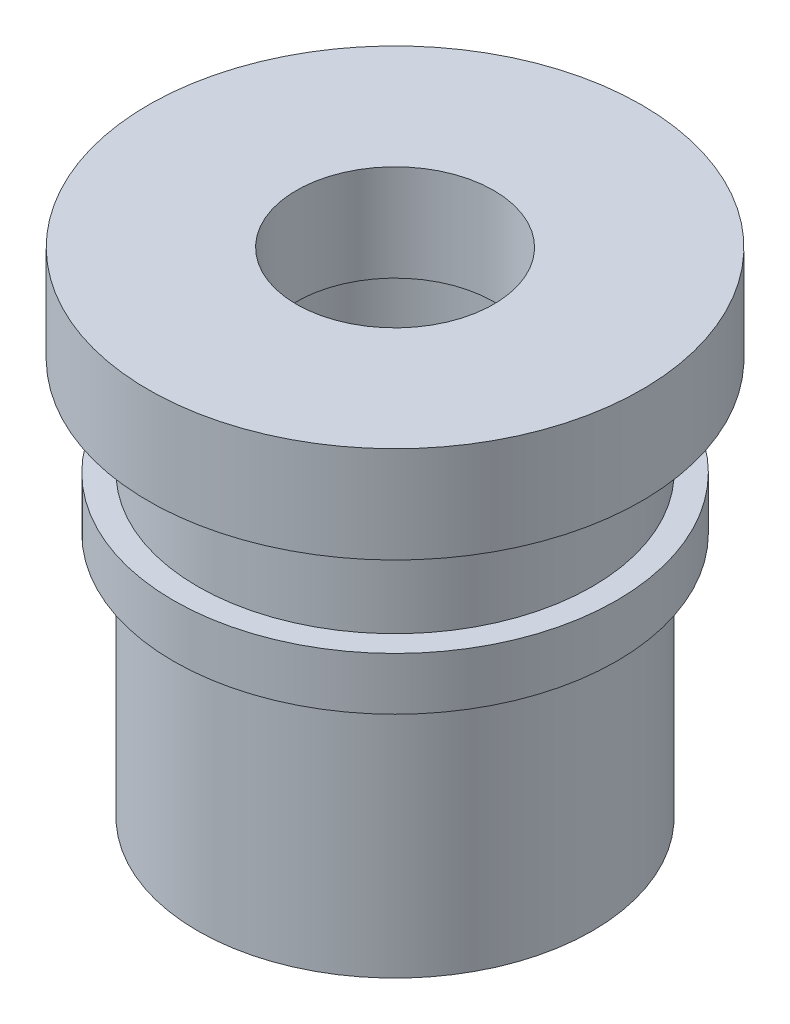
ISO-10303-21;
HEADER;
FILE_DESCRIPTION(('STEP AP214'),'2;1');
FILE_NAME('part.step','',(''),(''),'','','');
FILE_SCHEMA(('AUTOMOTIVE_DESIGN { 1 0 10303 214 1 1 1 1 }'));
ENDSEC;
DATA;
#1=APPLICATION_CONTEXT('core data for automotive mechanical design processes');
#2=APPLICATION_PROTOCOL_DEFINITION('international standard','automotive_design',2000,#1);
#3=PRODUCT_CONTEXT('',#1,'mechanical');
#4=PRODUCT('Part','Part','',(#3));
#5=PRODUCT_RELATED_PRODUCT_CATEGORY('part','',(#4));
#6=PRODUCT_DEFINITION_FORMATION('','',#4);
#7=PRODUCT_DEFINITION_CONTEXT('part definition',#1,'design');
#8=PRODUCT_DEFINITION('design','',#6,#7);
#9=PRODUCT_DEFINITION_SHAPE('','',#8);
#10=(LENGTH_UNIT() NAMED_UNIT(*) SI_UNIT(.MILLI.,.METRE.));
#11=(NAMED_UNIT(*) PLANE_ANGLE_UNIT() SI_UNIT($,.RADIAN.));
#12=(NAMED_UNIT(*) SI_UNIT($,.STERADIAN.) SOLID_ANGLE_UNIT());
#13=UNCERTAINTY_MEASURE_WITH_UNIT(LENGTH_MEASURE(1.E-05),#10,'distance_accuracy_value','');
#14=(GEOMETRIC_REPRESENTATION_CONTEXT(3) GLOBAL_UNCERTAINTY_ASSIGNED_CONTEXT((#13)) GLOBAL_UNIT_ASSIGNED_CONTEXT((#10,
#11,#12)) REPRESENTATION_CONTEXT('',''));
#15=CARTESIAN_POINT('',(0.,0.,0.));
#16=DIRECTION('',(0.,0.,1.));
#17=DIRECTION('',(1.,0.,0.));
#18=AXIS2_PLACEMENT_3D('',#15,#16,#17);
#19=CARTESIAN_POINT('',(0.,0.,0.));
#20=DIRECTION('',(0.,-1.,0.));
#21=DIRECTION('',(0.,0.,-1.));
#22=AXIS2_PLACEMENT_3D('',#19,#20,#21);
#23=CYLINDRICAL_SURFACE('',#22,3.96875);
#24=CARTESIAN_POINT('',(0.,7.9375,0.));
#25=DIRECTION('',(0.,-1.,0.));
#26=DIRECTION('',(0.,0.,-1.));
#27=AXIS2_PLACEMENT_3D('',#24,#25,#26);
#28=CIRCLE('',#27,3.96875);
#29=CARTESIAN_POINT('',(0.,7.9375,-3.96875));
#30=VERTEX_POINT('',#29);
#31=EDGE_CURVE('E72',#30,#30,#28,.T.);
#32=ORIENTED_EDGE('',*,*,#31,.T.);
#33=EDGE_LOOP('',(#32));
#34=FACE_BOUND('',#33,.T.);
#35=CARTESIAN_POINT('',(0.,6.38646458904579,0.));
#36=DIRECTION('',(0.,-1.,0.));
#37=DIRECTION('',(0.,0.,-1.));
#38=AXIS2_PLACEMENT_3D('',#35,#36,#37);
#39=CIRCLE('',#38,3.96875);
#40=CARTESIAN_POINT('',(0.,6.38646458904579,-3.96875));
#41=VERTEX_POINT('',#40);
#42=EDGE_CURVE('E10',#41,#41,#39,.T.);
#43=ORIENTED_EDGE('',*,*,#42,.F.);
#44=EDGE_LOOP('',(#43));
#45=FACE_BOUND('',#44,.T.);
#46=ADVANCED_FACE('F32',(#34,#45),#23,.T.);
#47=CARTESIAN_POINT('',(3.96875,6.38646458904579,0.));
#48=DIRECTION('',(0.,-1.,0.));
#49=DIRECTION('',(0.,0.,-1.));
#50=AXIS2_PLACEMENT_3D('',#47,#48,#49);
#51=PLANE('',#50);
#52=ORIENTED_EDGE('',*,*,#42,.T.);
#53=EDGE_LOOP('',(#52));
#54=FACE_BOUND('',#53,.T.);
#55=CARTESIAN_POINT('',(0.,6.38646458904579,0.));
#56=DIRECTION('',(0.,-1.,0.));
#57=DIRECTION('',(0.,0.,-1.));
#58=AXIS2_PLACEMENT_3D('',#55,#56,#57);
#59=CIRCLE('',#58,3.175);
#60=CARTESIAN_POINT('',(0.,6.38646458904579,-3.175));
#61=VERTEX_POINT('',#60);
#62=EDGE_CURVE('E38',#61,#61,#59,.T.);
#63=ORIENTED_EDGE('',*,*,#62,.F.);
#64=EDGE_LOOP('',(#63));
#65=FACE_BOUND('',#64,.T.);
#66=ADVANCED_FACE('F90',(#54,#65),#51,.T.);
#67=CARTESIAN_POINT('',(0.,0.,0.));
#68=DIRECTION('',(0.,-1.,0.));
#69=DIRECTION('',(0.,0.,-1.));
#70=AXIS2_PLACEMENT_3D('',#67,#68,#69);
#71=CYLINDRICAL_SURFACE('',#70,3.175);
#72=ORIENTED_EDGE('',*,*,#62,.T.);
#73=EDGE_LOOP('',(#72));
#74=FACE_BOUND('',#73,.T.);
#75=CARTESIAN_POINT('',(0.,4.79896458904579,0.));
#76=DIRECTION('',(0.,-1.,0.));
#77=DIRECTION('',(0.,0.,-1.));
#78=AXIS2_PLACEMENT_3D('',#75,#76,#77);
#79=CIRCLE('',#78,3.175);
#80=CARTESIAN_POINT('',(0.,4.79896458904579,-3.175));
#81=VERTEX_POINT('',#80);
#82=EDGE_CURVE('E42',#81,#81,#79,.T.);
#83=ORIENTED_EDGE('',*,*,#82,.F.);
#84=EDGE_LOOP('',(#83));
#85=FACE_BOUND('',#84,.T.);
#86=ADVANCED_FACE('F94',(#74,#85),#71,.T.);
#87=CARTESIAN_POINT('',(3.175,4.79896458904579,0.));
#88=DIRECTION('',(0.,1.,0.));
#89=DIRECTION('',(0.,0.,1.));
#90=AXIS2_PLACEMENT_3D('',#87,#88,#89);
#91=PLANE('',#90);
#92=ORIENTED_EDGE('',*,*,#82,.T.);
#93=EDGE_LOOP('',(#92));
#94=FACE_BOUND('',#93,.T.);
#95=CARTESIAN_POINT('',(0.,4.79896458904579,0.));
#96=DIRECTION('',(0.,-1.,0.));
#97=DIRECTION('',(0.,0.,-1.));
#98=AXIS2_PLACEMENT_3D('',#95,#96,#97);
#99=CIRCLE('',#98,3.56421910469719);
#100=CARTESIAN_POINT('',(0.,4.79896458904579,-3.56421910469719));
#101=VERTEX_POINT('',#100);
#102=EDGE_CURVE('E46',#101,#101,#99,.T.);
#103=ORIENTED_EDGE('',*,*,#102,.F.);
#104=EDGE_LOOP('',(#103));
#105=FACE_BOUND('',#104,.T.);
#106=ADVANCED_FACE('F98',(#94,#105),#91,.T.);
#107=CARTESIAN_POINT('',(0.,0.,0.));
#108=DIRECTION('',(0.,-1.,0.));
#109=DIRECTION('',(0.,0.,-1.));
#110=AXIS2_PLACEMENT_3D('',#107,#108,#109);
#111=CYLINDRICAL_SURFACE('',#110,3.56421910469719);
#112=ORIENTED_EDGE('',*,*,#102,.T.);
#113=EDGE_LOOP('',(#112));
#114=FACE_BOUND('',#113,.T.);
#115=CARTESIAN_POINT('',(0.,3.95175218971324,0.));
#116=DIRECTION('',(0.,-1.,0.));
#117=DIRECTION('',(0.,0.,-1.));
#118=AXIS2_PLACEMENT_3D('',#115,#116,#117);
#119=CIRCLE('',#118,3.56421910469719);
#120=CARTESIAN_POINT('',(0.,3.95175218971324,-3.56421910469719));
#121=VERTEX_POINT('',#120);
#122=EDGE_CURVE('E51',#121,#121,#119,.T.);
#123=ORIENTED_EDGE('',*,*,#122,.F.);
#124=EDGE_LOOP('',(#123));
#125=FACE_BOUND('',#124,.T.);
#126=ADVANCED_FACE('F104',(#114,#125),#111,.T.);
#127=CARTESIAN_POINT('',(3.56421910469719,3.95175218971324,0.));
#128=DIRECTION('',(0.,-1.,0.));
#129=DIRECTION('',(0.,0.,-1.));
#130=AXIS2_PLACEMENT_3D('',#127,#128,#129);
#131=PLANE('',#130);
#132=ORIENTED_EDGE('',*,*,#122,.T.);
#133=EDGE_LOOP('',(#132));
#134=FACE_BOUND('',#133,.T.);
#135=CARTESIAN_POINT('',(0.,3.95175218971324,0.));
#136=DIRECTION('',(0.,-1.,0.));
#137=DIRECTION('',(0.,0.,-1.));
#138=AXIS2_PLACEMENT_3D('',#135,#136,#137);
#139=CIRCLE('',#138,3.175);
#140=CARTESIAN_POINT('',(0.,3.95175218971324,-3.175));
#141=VERTEX_POINT('',#140);
#142=EDGE_CURVE('E54',#141,#141,#139,.T.);
#143=ORIENTED_EDGE('',*,*,#142,.F.);
#144=EDGE_LOOP('',(#143));
#145=FACE_BOUND('',#144,.T.);
#146=ADVANCED_FACE('F108',(#134,#145),#131,.T.);
#147=CARTESIAN_POINT('',(0.,0.,0.));
#148=DIRECTION('',(0.,-1.,0.));
#149=DIRECTION('',(0.,0.,-1.));
#150=AXIS2_PLACEMENT_3D('',#147,#148,#149);
#151=CYLINDRICAL_SURFACE('',#150,3.175);
#152=ORIENTED_EDGE('',*,*,#142,.T.);
#153=EDGE_LOOP('',(#152));
#154=FACE_BOUND('',#153,.T.);
#155=CARTESIAN_POINT('',(0.,0.,0.));
#156=DIRECTION('',(0.,-1.,0.));
#157=DIRECTION('',(0.,0.,-1.));
#158=AXIS2_PLACEMENT_3D('',#155,#156,#157);
#159=CIRCLE('',#158,3.175);
#160=CARTESIAN_POINT('',(0.,0.,-3.175));
#161=VERTEX_POINT('',#160);
#162=EDGE_CURVE('E57',#161,#161,#159,.T.);
#163=ORIENTED_EDGE('',*,*,#162,.F.);
#164=EDGE_LOOP('',(#163));
#165=FACE_BOUND('',#164,.T.);
#166=ADVANCED_FACE('F112',(#154,#165),#151,.T.);
#167=CARTESIAN_POINT('',(3.175,0.,0.));
#168=DIRECTION('',(0.,-1.,0.));
#169=DIRECTION('',(0.,0.,-1.));
#170=AXIS2_PLACEMENT_3D('',#167,#168,#169);
#171=PLANE('',#170);
#172=ORIENTED_EDGE('',*,*,#162,.T.);
#173=EDGE_LOOP('',(#172));
#174=FACE_BOUND('',#173,.T.);
#175=CARTESIAN_POINT('',(0.,0.,0.));
#176=DIRECTION('',(0.,-1.,0.));
#177=DIRECTION('',(0.,0.,-1.));
#178=AXIS2_PLACEMENT_3D('',#175,#176,#177);
#179=CIRCLE('',#178,1.89778658523785);
#180=CARTESIAN_POINT('',(0.,0.,-1.89778658523785));
#181=VERTEX_POINT('',#180);
#182=EDGE_CURVE('E60',#181,#181,#179,.T.);
#183=ORIENTED_EDGE('',*,*,#182,.F.);
#184=EDGE_LOOP('',(#183));
#185=FACE_BOUND('',#184,.T.);
#186=ADVANCED_FACE('F116',(#174,#185),#171,.T.);
#187=CARTESIAN_POINT('',(0.,0.,0.));
#188=DIRECTION('',(0.,-1.,0.));
#189=DIRECTION('',(0.,0.,-1.));
#190=AXIS2_PLACEMENT_3D('',#187,#188,#189);
#191=CYLINDRICAL_SURFACE('',#190,1.89778658523785);
#192=ORIENTED_EDGE('',*,*,#182,.T.);
#193=EDGE_LOOP('',(#192));
#194=FACE_BOUND('',#193,.T.);
#195=CARTESIAN_POINT('',(0.,6.38646458904579,0.));
#196=DIRECTION('',(0.,-1.,0.));
#197=DIRECTION('',(0.,0.,-1.));
#198=AXIS2_PLACEMENT_3D('',#195,#196,#197);
#199=CIRCLE('',#198,1.89778658523785);
#200=CARTESIAN_POINT('',(0.,6.38646458904579,-1.89778658523785));
#201=VERTEX_POINT('',#200);
#202=EDGE_CURVE('E63',#201,#201,#199,.T.);
#203=ORIENTED_EDGE('',*,*,#202,.F.);
#204=EDGE_LOOP('',(#203));
#205=FACE_BOUND('',#204,.T.);
#206=ADVANCED_FACE('F120',(#194,#205),#191,.F.);
#207=CARTESIAN_POINT('',(1.89778658523785,6.38646458904579,0.));
#208=DIRECTION('',(0.,-1.,0.));
#209=DIRECTION('',(0.,0.,-1.));
#210=AXIS2_PLACEMENT_3D('',#207,#208,#209);
#211=PLANE('',#210);
#212=ORIENTED_EDGE('',*,*,#202,.T.);
#213=EDGE_LOOP('',(#212));
#214=FACE_BOUND('',#213,.T.);
#215=CARTESIAN_POINT('',(0.,6.38646458904579,0.));
#216=DIRECTION('',(0.,-1.,0.));
#217=DIRECTION('',(0.,0.,-1.));
#218=AXIS2_PLACEMENT_3D('',#215,#216,#217);
#219=CIRCLE('',#218,1.5875);
#220=CARTESIAN_POINT('',(0.,6.38646458904579,-1.5875));
#221=VERTEX_POINT('',#220);
#222=EDGE_CURVE('E66',#221,#221,#219,.T.);
#223=ORIENTED_EDGE('',*,*,#222,.F.);
#224=EDGE_LOOP('',(#223));
#225=FACE_BOUND('',#224,.T.);
#226=ADVANCED_FACE('F86',(#214,#225),#211,.T.);
#227=CARTESIAN_POINT('',(0.,0.,0.));
#228=DIRECTION('',(0.,-1.,0.));
#229=DIRECTION('',(0.,0.,-1.));
#230=AXIS2_PLACEMENT_3D('',#227,#228,#229);
#231=CYLINDRICAL_SURFACE('',#230,1.5875);
#232=ORIENTED_EDGE('',*,*,#222,.T.);
#233=EDGE_LOOP('',(#232));
#234=FACE_BOUND('',#233,.T.);
#235=CARTESIAN_POINT('',(0.,7.9375,0.));
#236=DIRECTION('',(0.,-1.,0.));
#237=DIRECTION('',(0.,0.,-1.));
#238=AXIS2_PLACEMENT_3D('',#235,#236,#237);
#239=CIRCLE('',#238,1.5875);
#240=CARTESIAN_POINT('',(0.,7.9375,-1.5875));
#241=VERTEX_POINT('',#240);
#242=EDGE_CURVE('E69',#241,#241,#239,.T.);
#243=ORIENTED_EDGE('',*,*,#242,.F.);
#244=EDGE_LOOP('',(#243));
#245=FACE_BOUND('',#244,.T.);
#246=ADVANCED_FACE('F80',(#234,#245),#231,.F.);
#247=CARTESIAN_POINT('',(1.5875,7.9375,0.));
#248=DIRECTION('',(0.,1.,0.));
#249=DIRECTION('',(0.,0.,1.));
#250=AXIS2_PLACEMENT_3D('',#247,#248,#249);
#251=PLANE('',#250);
#252=ORIENTED_EDGE('',*,*,#242,.T.);
#253=EDGE_LOOP('',(#252));
#254=FACE_BOUND('',#253,.T.);
#255=ORIENTED_EDGE('',*,*,#31,.F.);
#256=EDGE_LOOP('',(#255));
#257=FACE_BOUND('',#256,.T.);
#258=ADVANCED_FACE('F78',(#254,#257),#251,.T.);
#259=CLOSED_SHELL('',(#46,#66,#86,#106,#126,#146,#166,#186,#206,#226,#246,#258));
#260=MANIFOLD_SOLID_BREP('B2',#259);
#261=ADVANCED_BREP_SHAPE_REPRESENTATION('',(#18,#260),#14);
#262=SHAPE_DEFINITION_REPRESENTATION(#9,#261);
ENDSEC;
END-ISO-10303-21;
